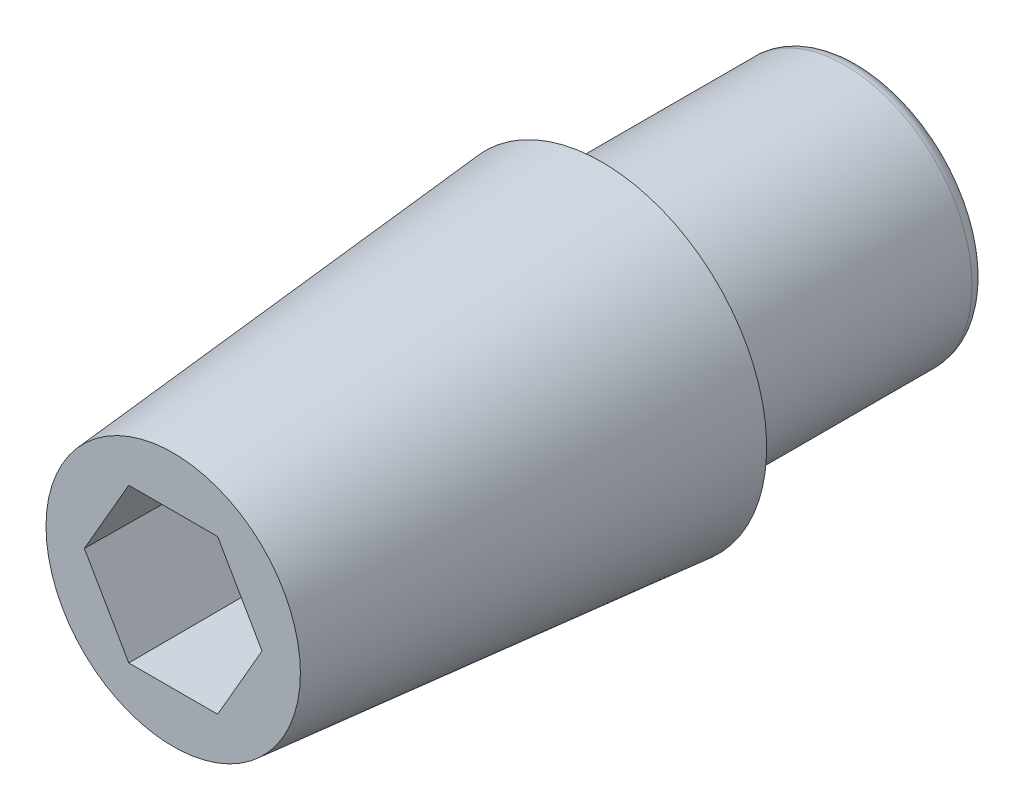
ISO-10303-21;
HEADER;
FILE_DESCRIPTION(('STEP AP214'),'2;1');
FILE_NAME('part.step','',(''),(''),'','','');
FILE_SCHEMA(('AUTOMOTIVE_DESIGN { 1 0 10303 214 1 1 1 1 }'));
ENDSEC;
DATA;
#1=APPLICATION_CONTEXT('core data for automotive mechanical design processes');
#2=APPLICATION_PROTOCOL_DEFINITION('international standard','automotive_design',2000,#1);
#3=PRODUCT_CONTEXT('',#1,'mechanical');
#4=PRODUCT('Part','Part','',(#3));
#5=PRODUCT_RELATED_PRODUCT_CATEGORY('part','',(#4));
#6=PRODUCT_DEFINITION_FORMATION('','',#4);
#7=PRODUCT_DEFINITION_CONTEXT('part definition',#1,'design');
#8=PRODUCT_DEFINITION('design','',#6,#7);
#9=PRODUCT_DEFINITION_SHAPE('','',#8);
#10=(LENGTH_UNIT() NAMED_UNIT(*) SI_UNIT(.MILLI.,.METRE.));
#11=(NAMED_UNIT(*) PLANE_ANGLE_UNIT() SI_UNIT($,.RADIAN.));
#12=(NAMED_UNIT(*) SI_UNIT($,.STERADIAN.) SOLID_ANGLE_UNIT());
#13=UNCERTAINTY_MEASURE_WITH_UNIT(LENGTH_MEASURE(1.E-05),#10,'distance_accuracy_value','');
#14=(GEOMETRIC_REPRESENTATION_CONTEXT(3) GLOBAL_UNCERTAINTY_ASSIGNED_CONTEXT((#13)) GLOBAL_UNIT_ASSIGNED_CONTEXT((#10,
#11,#12)) REPRESENTATION_CONTEXT('',''));
#15=CARTESIAN_POINT('',(0.,0.,0.));
#16=DIRECTION('',(0.,0.,1.));
#17=DIRECTION('',(1.,0.,0.));
#18=AXIS2_PLACEMENT_3D('',#15,#16,#17);
#19=CARTESIAN_POINT('',(-0.250000000000002,0.,-6.75));
#20=DIRECTION('',(0.,0.,1.));
#21=DIRECTION('',(1.,0.,0.));
#22=AXIS2_PLACEMENT_3D('',#19,#20,#21);
#23=PLANE('',#22);
#24=CARTESIAN_POINT('',(0.,0.,-6.75));
#25=DIRECTION('',(0.,0.,-1.));
#26=DIRECTION('',(0.,1.,0.));
#27=AXIS2_PLACEMENT_3D('',#24,#25,#26);
#28=CIRCLE('',#27,0.386494716716777);
#29=CARTESIAN_POINT('',(0.,0.386494716716777,-6.75));
#30=VERTEX_POINT('',#29);
#31=EDGE_CURVE('E20',#30,#30,#28,.T.);
#32=ORIENTED_EDGE('',*,*,#31,.F.);
#33=EDGE_LOOP('',(#32));
#34=FACE_BOUND('',#33,.T.);
#35=ADVANCED_FACE('F16',(#34),#23,.T.);
#36=CARTESIAN_POINT('',(0.,0.,-6.85));
#37=DIRECTION('',(0.,0.,-1.));
#38=DIRECTION('',(0.,1.,0.));
#39=AXIS2_PLACEMENT_3D('',#36,#37,#38);
#40=TOROIDAL_SURFACE('',#39,0.386494716716777,0.100000000000001);
#41=ORIENTED_EDGE('',*,*,#31,.T.);
#42=EDGE_LOOP('',(#41));
#43=FACE_BOUND('',#42,.T.);
#44=CARTESIAN_POINT('',(0.,0.,-6.84128442571819));
#45=DIRECTION('',(0.,0.,-1.));
#46=DIRECTION('',(-1.,0.,0.));
#47=AXIS2_PLACEMENT_3D('',#44,#45,#46);
#48=CIRCLE('',#47,0.486114186543316);
#49=CARTESIAN_POINT('',(-0.486114186543318,0.,-6.84128442571819));
#50=VERTEX_POINT('',#49);
#51=EDGE_CURVE('E106',#50,#50,#48,.T.);
#52=ORIENTED_EDGE('',*,*,#51,.F.);
#53=EDGE_LOOP('',(#52));
#54=FACE_BOUND('',#53,.T.);
#55=ADVANCED_FACE('F131',(#43,#54),#40,.T.);
#56=CARTESIAN_POINT('',(0.,0.,-6.90871557429773));
#57=DIRECTION('',(0.,0.,-1.));
#58=DIRECTION('',(0.,1.,0.));
#59=AXIS2_PLACEMENT_3D('',#56,#57,#58);
#60=CONICAL_SURFACE('',#59,0.492013647608756,0.087266462543748);
#61=ORIENTED_EDGE('',*,*,#51,.T.);
#62=EDGE_LOOP('',(#61));
#63=FACE_BOUND('',#62,.T.);
#64=CARTESIAN_POINT('',(0.,0.,-6.90871557427476));
#65=DIRECTION('',(0.,0.,1.));
#66=DIRECTION('',(1.,0.,0.));
#67=AXIS2_PLACEMENT_3D('',#64,#65,#66);
#68=CIRCLE('',#67,0.492013647592567);
#69=CARTESIAN_POINT('',(0.492013647592565,0.,-6.90871557427476));
#70=VERTEX_POINT('',#69);
#71=EDGE_CURVE('E102',#70,#70,#68,.T.);
#72=ORIENTED_EDGE('',*,*,#71,.T.);
#73=EDGE_LOOP('',(#72));
#74=FACE_BOUND('',#73,.T.);
#75=ADVANCED_FACE('F122',(#63,#74),#60,.T.);
#76=CARTESIAN_POINT('',(0.,0.,-6.9));
#77=DIRECTION('',(0.,0.,-1.));
#78=DIRECTION('',(-1.,0.,0.));
#79=AXIS2_PLACEMENT_3D('',#76,#77,#78);
#80=TOROIDAL_SURFACE('',#79,0.591633117401737,0.0999999999999965);
#81=ORIENTED_EDGE('',*,*,#71,.F.);
#82=EDGE_LOOP('',(#81));
#83=FACE_BOUND('',#82,.T.);
#84=CARTESIAN_POINT('',(0.,0.,-7.));
#85=DIRECTION('',(0.,0.,-1.));
#86=DIRECTION('',(-1.,0.,0.));
#87=AXIS2_PLACEMENT_3D('',#84,#85,#86);
#88=CIRCLE('',#87,0.591633117401743);
#89=CARTESIAN_POINT('',(-0.591633117401745,0.,-7.));
#90=VERTEX_POINT('',#89);
#91=EDGE_CURVE('E105',#90,#90,#88,.T.);
#92=ORIENTED_EDGE('',*,*,#91,.F.);
#93=EDGE_LOOP('',(#92));
#94=FACE_BOUND('',#93,.T.);
#95=ADVANCED_FACE('F119',(#83,#94),#80,.F.);
#96=CARTESIAN_POINT('',(2.225,0.,-9.));
#97=DIRECTION('',(0.,0.,-1.));
#98=DIRECTION('',(-1.,0.,0.));
#99=AXIS2_PLACEMENT_3D('',#96,#97,#98);
#100=PLANE('',#99);
#101=CARTESIAN_POINT('',(0.,0.,-9.));
#102=DIRECTION('',(0.,0.,1.));
#103=DIRECTION('',(0.,-1.,0.));
#104=AXIS2_PLACEMENT_3D('',#101,#102,#103);
#105=CIRCLE('',#104,3.95);
#106=CARTESIAN_POINT('',(0.,-3.95,-9.));
#107=VERTEX_POINT('',#106);
#108=EDGE_CURVE('E87',#107,#107,#105,.T.);
#109=ORIENTED_EDGE('',*,*,#108,.F.);
#110=EDGE_LOOP('',(#109));
#111=FACE_BOUND('',#110,.T.);
#112=ADVANCED_FACE('F121',(#111),#100,.T.);
#113=CARTESIAN_POINT('',(0.,0.,-7.));
#114=DIRECTION('',(0.,0.,1.));
#115=DIRECTION('',(1.,0.,0.));
#116=AXIS2_PLACEMENT_3D('',#113,#114,#115);
#117=PLANE('',#116);
#118=DIRECTION('',(-0.5,-0.866025403784439,0.));
#119=VECTOR('',#118,1.);
#120=CARTESIAN_POINT('',(-1.44337567297406,2.5,-7.));
#121=LINE('',#120,#119);
#122=CARTESIAN_POINT('',(-1.44337567297406,2.5,-7.));
#123=VERTEX_POINT('',#122);
#124=CARTESIAN_POINT('',(-2.88675134594813,0.,-7.));
#125=VERTEX_POINT('',#124);
#126=EDGE_CURVE('E328',#123,#125,#121,.T.);
#127=ORIENTED_EDGE('',*,*,#126,.T.);
#128=DIRECTION('',(0.499999999999999,-0.866025403784439,0.));
#129=VECTOR('',#128,1.);
#130=CARTESIAN_POINT('',(-2.88675134594813,0.,-7.));
#131=LINE('',#130,#129);
#132=CARTESIAN_POINT('',(-1.44337567297407,-2.5,-7.));
#133=VERTEX_POINT('',#132);
#134=EDGE_CURVE('E312',#125,#133,#131,.T.);
#135=ORIENTED_EDGE('',*,*,#134,.T.);
#136=DIRECTION('',(1.,0.,0.));
#137=VECTOR('',#136,1.);
#138=CARTESIAN_POINT('',(-1.44337567297407,-2.5,-7.));
#139=LINE('',#138,#137);
#140=CARTESIAN_POINT('',(1.44337567297406,-2.5,-7.));
#141=VERTEX_POINT('',#140);
#142=EDGE_CURVE('E307',#133,#141,#139,.T.);
#143=ORIENTED_EDGE('',*,*,#142,.T.);
#144=DIRECTION('',(0.5,0.866025403784439,0.));
#145=VECTOR('',#144,1.);
#146=CARTESIAN_POINT('',(1.44337567297406,-2.5,-7.));
#147=LINE('',#146,#145);
#148=CARTESIAN_POINT('',(2.88675134594813,0.,-7.));
#149=VERTEX_POINT('',#148);
#150=EDGE_CURVE('E68',#141,#149,#147,.T.);
#151=ORIENTED_EDGE('',*,*,#150,.T.);
#152=DIRECTION('',(-0.499999999999999,0.866025403784439,0.));
#153=VECTOR('',#152,1.);
#154=CARTESIAN_POINT('',(2.88675134594813,0.,-7.));
#155=LINE('',#154,#153);
#156=CARTESIAN_POINT('',(1.44337567297406,2.5,-7.));
#157=VERTEX_POINT('',#156);
#158=EDGE_CURVE('E70',#149,#157,#155,.T.);
#159=ORIENTED_EDGE('',*,*,#158,.T.);
#160=DIRECTION('',(1.,0.,0.));
#161=VECTOR('',#160,1.);
#162=CARTESIAN_POINT('',(1.44337567297406,2.5,-7.));
#163=LINE('',#162,#161);
#164=EDGE_CURVE('E74',#157,#123,#163,.F.);
#165=ORIENTED_EDGE('',*,*,#164,.T.);
#166=EDGE_LOOP('',(#127,#135,#143,#151,#159,#165));
#167=FACE_BOUND('',#166,.T.);
#168=ORIENTED_EDGE('',*,*,#91,.T.);
#169=EDGE_LOOP('',(#168));
#170=FACE_BOUND('',#169,.T.);
#171=ADVANCED_FACE('F72',(#167,#170),#117,.T.);
#172=CARTESIAN_POINT('',(0.,0.,-8.5));
#173=DIRECTION('',(0.,0.,1.));
#174=DIRECTION('',(0.,-1.,0.));
#175=AXIS2_PLACEMENT_3D('',#172,#173,#174);
#176=TOROIDAL_SURFACE('',#175,3.95,0.5);
#177=ORIENTED_EDGE('',*,*,#108,.T.);
#178=EDGE_LOOP('',(#177));
#179=FACE_BOUND('',#178,.T.);
#180=CARTESIAN_POINT('',(0.,0.,-8.5));
#181=DIRECTION('',(0.,0.,1.));
#182=DIRECTION('',(1.,0.,0.));
#183=AXIS2_PLACEMENT_3D('',#180,#181,#182);
#184=CIRCLE('',#183,4.45);
#185=CARTESIAN_POINT('',(4.45,0.,-8.5));
#186=VERTEX_POINT('',#185);
#187=EDGE_CURVE('E98',#186,#186,#184,.T.);
#188=ORIENTED_EDGE('',*,*,#187,.F.);
#189=EDGE_LOOP('',(#188));
#190=FACE_BOUND('',#189,.T.);
#191=ADVANCED_FACE('F18',(#179,#190),#176,.T.);
#192=CARTESIAN_POINT('',(1.44337567297406,2.5,-7.));
#193=DIRECTION('',(0.,0.999961923064171,-0.00872653549837401));
#194=DIRECTION('',(0.,0.00872653549837401,0.999961923064171));
#195=AXIS2_PLACEMENT_3D('',#192,#193,#194);
#196=PLANE('',#195);
#197=ORIENTED_EDGE('',*,*,#164,.F.);
#198=DIRECTION('',(0.00503820367424967,0.00872642474268049,0.999949231718764));
#199=VECTOR('',#198,1.);
#200=CARTESIAN_POINT('',(1.44337567297406,2.5,-7.));
#201=LINE('',#200,#199);
#202=CARTESIAN_POINT('',(1.55422178127396,2.69199109139669,15.));
#203=VERTEX_POINT('',#202);
#204=EDGE_CURVE('E79',#157,#203,#201,.T.);
#205=ORIENTED_EDGE('',*,*,#204,.T.);
#206=DIRECTION('',(1.,0.,0.));
#207=VECTOR('',#206,1.);
#208=CARTESIAN_POINT('',(2.225,2.6919910913967,15.));
#209=LINE('',#208,#207);
#210=CARTESIAN_POINT('',(-1.55422178127395,2.6919910913967,15.));
#211=VERTEX_POINT('',#210);
#212=EDGE_CURVE('E101',#211,#203,#209,.T.);
#213=ORIENTED_EDGE('',*,*,#212,.F.);
#214=DIRECTION('',(0.00503820367424958,-0.0087264247426806,-0.999949231718764));
#215=VECTOR('',#214,1.);
#216=CARTESIAN_POINT('',(-1.55422178127395,2.6919910913967,15.));
#217=LINE('',#216,#215);
#218=EDGE_CURVE('E85',#211,#123,#217,.T.);
#219=ORIENTED_EDGE('',*,*,#218,.T.);
#220=EDGE_LOOP('',(#197,#205,#213,#219));
#221=FACE_BOUND('',#220,.T.);
#222=ADVANCED_FACE('F82',(#221),#196,.F.);
#223=CARTESIAN_POINT('',(2.88675134594813,0.,-7.));
#224=DIRECTION('',(0.865992428190713,0.499980961532085,-0.008726535498374));
#225=DIRECTION('',(-0.499999999999999,0.866025403784439,0.));
#226=AXIS2_PLACEMENT_3D('',#223,#224,#225);
#227=PLANE('',#226);
#228=ORIENTED_EDGE('',*,*,#158,.F.);
#229=DIRECTION('',(0.0100764073484993,0.,0.999949231718764));
#230=VECTOR('',#229,1.);
#231=CARTESIAN_POINT('',(2.88675134594813,0.,-7.));
#232=LINE('',#231,#230);
#233=CARTESIAN_POINT('',(3.10844356254791,0.,15.));
#234=VERTEX_POINT('',#233);
#235=EDGE_CURVE('E94',#149,#234,#232,.T.);
#236=ORIENTED_EDGE('',*,*,#235,.T.);
#237=DIRECTION('',(0.499999999999999,-0.866025403784439,0.));
#238=VECTOR('',#237,1.);
#239=CARTESIAN_POINT('',(1.55422178127396,2.69199109139669,15.));
#240=LINE('',#239,#238);
#241=EDGE_CURVE('E91',#203,#234,#240,.T.);
#242=ORIENTED_EDGE('',*,*,#241,.F.);
#243=ORIENTED_EDGE('',*,*,#204,.F.);
#244=EDGE_LOOP('',(#228,#236,#242,#243));
#245=FACE_BOUND('',#244,.T.);
#246=ADVANCED_FACE('F89',(#245),#227,.F.);
#247=CARTESIAN_POINT('',(1.44337567297406,-2.5,-7.));
#248=DIRECTION('',(0.865992428190713,-0.499980961532086,-0.008726535498374));
#249=DIRECTION('',(0.5,0.866025403784439,0.));
#250=AXIS2_PLACEMENT_3D('',#247,#248,#249);
#251=PLANE('',#250);
#252=ORIENTED_EDGE('',*,*,#150,.F.);
#253=DIRECTION('',(0.00503820367424961,-0.00872642474268054,0.999949231718764));
#254=VECTOR('',#253,1.);
#255=CARTESIAN_POINT('',(1.44337567297406,-2.5,-7.));
#256=LINE('',#255,#254);
#257=CARTESIAN_POINT('',(1.55422178127395,-2.6919910913967,15.));
#258=VERTEX_POINT('',#257);
#259=EDGE_CURVE('E304',#141,#258,#256,.T.);
#260=ORIENTED_EDGE('',*,*,#259,.T.);
#261=DIRECTION('',(-0.5,-0.866025403784438,0.));
#262=VECTOR('',#261,1.);
#263=CARTESIAN_POINT('',(3.10844356254791,0.,15.));
#264=LINE('',#263,#262);
#265=EDGE_CURVE('E318',#234,#258,#264,.T.);
#266=ORIENTED_EDGE('',*,*,#265,.F.);
#267=ORIENTED_EDGE('',*,*,#235,.F.);
#268=EDGE_LOOP('',(#252,#260,#266,#267));
#269=FACE_BOUND('',#268,.T.);
#270=ADVANCED_FACE('F166',(#269),#251,.F.);
#271=CARTESIAN_POINT('',(-1.44337567297407,-2.5,-7.));
#272=DIRECTION('',(0.,-0.999961923064171,-0.00872653549837401));
#273=DIRECTION('',(0.,0.00872653549837401,-0.999961923064171));
#274=AXIS2_PLACEMENT_3D('',#271,#272,#273);
#275=PLANE('',#274);
#276=ORIENTED_EDGE('',*,*,#142,.F.);
#277=DIRECTION('',(-0.00503820367424962,-0.00872642474268057,0.999949231718764));
#278=VECTOR('',#277,1.);
#279=CARTESIAN_POINT('',(-1.44337567297407,-2.5,-7.));
#280=LINE('',#279,#278);
#281=CARTESIAN_POINT('',(-1.55422178127396,-2.69199109139669,15.));
#282=VERTEX_POINT('',#281);
#283=EDGE_CURVE('E314',#133,#282,#280,.T.);
#284=ORIENTED_EDGE('',*,*,#283,.T.);
#285=DIRECTION('',(1.,0.,0.));
#286=VECTOR('',#285,1.);
#287=CARTESIAN_POINT('',(2.225,-2.6919910913967,15.));
#288=LINE('',#287,#286);
#289=EDGE_CURVE('E310',#258,#282,#288,.F.);
#290=ORIENTED_EDGE('',*,*,#289,.F.);
#291=ORIENTED_EDGE('',*,*,#259,.F.);
#292=EDGE_LOOP('',(#276,#284,#290,#291));
#293=FACE_BOUND('',#292,.T.);
#294=ADVANCED_FACE('F163',(#293),#275,.F.);
#295=CARTESIAN_POINT('',(-2.88675134594813,0.,-7.));
#296=DIRECTION('',(-0.865992428190713,-0.499980961532085,-0.008726535498374));
#297=DIRECTION('',(0.499999999999999,-0.866025403784439,0.));
#298=AXIS2_PLACEMENT_3D('',#295,#296,#297);
#299=PLANE('',#298);
#300=ORIENTED_EDGE('',*,*,#134,.F.);
#301=DIRECTION('',(-0.0100764073484993,0.,0.999949231718764));
#302=VECTOR('',#301,1.);
#303=CARTESIAN_POINT('',(-2.88675134594813,0.,-7.));
#304=LINE('',#303,#302);
#305=CARTESIAN_POINT('',(-3.10844356254791,0.,15.));
#306=VERTEX_POINT('',#305);
#307=EDGE_CURVE('E35',#125,#306,#304,.T.);
#308=ORIENTED_EDGE('',*,*,#307,.T.);
#309=DIRECTION('',(-0.5,0.866025403784439,0.));
#310=VECTOR('',#309,1.);
#311=CARTESIAN_POINT('',(-1.55422178127396,-2.69199109139669,15.));
#312=LINE('',#311,#310);
#313=EDGE_CURVE('E330',#282,#306,#312,.T.);
#314=ORIENTED_EDGE('',*,*,#313,.F.);
#315=ORIENTED_EDGE('',*,*,#283,.F.);
#316=EDGE_LOOP('',(#300,#308,#314,#315));
#317=FACE_BOUND('',#316,.T.);
#318=ADVANCED_FACE('F159',(#317),#299,.F.);
#319=CARTESIAN_POINT('',(-1.44337567297406,2.5,-7.));
#320=DIRECTION('',(-0.865992428190713,0.499980961532086,-0.008726535498374));
#321=DIRECTION('',(-0.5,-0.866025403784439,0.));
#322=AXIS2_PLACEMENT_3D('',#319,#320,#321);
#323=PLANE('',#322);
#324=ORIENTED_EDGE('',*,*,#126,.F.);
#325=ORIENTED_EDGE('',*,*,#218,.F.);
#326=DIRECTION('',(0.5,0.866025403784438,0.));
#327=VECTOR('',#326,1.);
#328=CARTESIAN_POINT('',(-3.10844356254791,0.,15.));
#329=LINE('',#328,#327);
#330=EDGE_CURVE('E114',#306,#211,#329,.T.);
#331=ORIENTED_EDGE('',*,*,#330,.F.);
#332=ORIENTED_EDGE('',*,*,#307,.F.);
#333=EDGE_LOOP('',(#324,#325,#331,#332));
#334=FACE_BOUND('',#333,.T.);
#335=ADVANCED_FACE('F155',(#334),#323,.F.);
#336=CARTESIAN_POINT('',(0.,0.,3.));
#337=DIRECTION('',(0.,0.,1.));
#338=DIRECTION('',(1.,0.,0.));
#339=AXIS2_PLACEMENT_3D('',#336,#337,#338);
#340=CYLINDRICAL_SURFACE('',#339,4.45);
#341=ORIENTED_EDGE('',*,*,#187,.T.);
#342=EDGE_LOOP('',(#341));
#343=FACE_BOUND('',#342,.T.);
#344=CARTESIAN_POINT('',(0.,0.,0.));
#345=DIRECTION('',(0.,0.,1.));
#346=DIRECTION('',(1.,0.,0.));
#347=AXIS2_PLACEMENT_3D('',#344,#345,#346);
#348=CIRCLE('',#347,4.45);
#349=CARTESIAN_POINT('',(4.45,0.,0.));
#350=VERTEX_POINT('',#349);
#351=EDGE_CURVE('E111',#350,#350,#348,.T.);
#352=ORIENTED_EDGE('',*,*,#351,.F.);
#353=EDGE_LOOP('',(#352));
#354=FACE_BOUND('',#353,.T.);
#355=ADVANCED_FACE('F151',(#343,#354),#340,.T.);
#356=CARTESIAN_POINT('',(2.225,0.,15.));
#357=DIRECTION('',(0.,0.,1.));
#358=DIRECTION('',(1.,0.,0.));
#359=AXIS2_PLACEMENT_3D('',#356,#357,#358);
#360=PLANE('',#359);
#361=CARTESIAN_POINT('',(0.,0.,14.9999999999864));
#362=DIRECTION('',(0.,0.,-1.));
#363=DIRECTION('',(-1.,0.,0.));
#364=AXIS2_PLACEMENT_3D('',#361,#362,#363);
#365=CIRCLE('',#364,4.44999999999141);
#366=CARTESIAN_POINT('',(-4.44999999999141,0.,14.9999999999864));
#367=VERTEX_POINT('',#366);
#368=EDGE_CURVE('E26',#367,#367,#365,.T.);
#369=ORIENTED_EDGE('',*,*,#368,.F.);
#370=EDGE_LOOP('',(#369));
#371=FACE_BOUND('',#370,.T.);
#372=ORIENTED_EDGE('',*,*,#313,.T.);
#373=ORIENTED_EDGE('',*,*,#330,.T.);
#374=ORIENTED_EDGE('',*,*,#212,.T.);
#375=ORIENTED_EDGE('',*,*,#241,.T.);
#376=ORIENTED_EDGE('',*,*,#265,.T.);
#377=ORIENTED_EDGE('',*,*,#289,.T.);
#378=EDGE_LOOP('',(#372,#373,#374,#375,#376,#377));
#379=FACE_BOUND('',#378,.T.);
#380=ADVANCED_FACE('F144',(#371,#379),#360,.T.);
#381=CARTESIAN_POINT('',(4.45,0.,0.));
#382=DIRECTION('',(0.,0.,-1.));
#383=DIRECTION('',(-1.,0.,0.));
#384=AXIS2_PLACEMENT_3D('',#381,#382,#383);
#385=PLANE('',#384);
#386=CARTESIAN_POINT('',(0.,0.,-1.13686482306521E-10));
#387=DIRECTION('',(0.,0.,-1.));
#388=DIRECTION('',(-1.,0.,0.));
#389=AXIS2_PLACEMENT_3D('',#386,#387,#388);
#390=CIRCLE('',#389,5.76232995137573);
#391=CARTESIAN_POINT('',(-5.76232995137573,0.,-1.13686126891426E-10));
#392=VERTEX_POINT('',#391);
#393=EDGE_CURVE('E9',#392,#392,#390,.F.);
#394=ORIENTED_EDGE('',*,*,#393,.F.);
#395=EDGE_LOOP('',(#394));
#396=FACE_BOUND('',#395,.T.);
#397=ORIENTED_EDGE('',*,*,#351,.T.);
#398=EDGE_LOOP('',(#397));
#399=FACE_BOUND('',#398,.T.);
#400=ADVANCED_FACE('F138',(#396,#399),#385,.T.);
#401=CARTESIAN_POINT('',(0.,0.,-1.70530611997519E-10));
#402=DIRECTION('',(0.,0.,-1.));
#403=DIRECTION('',(-1.,0.,0.));
#404=AXIS2_PLACEMENT_3D('',#401,#402,#403);
#405=CONICAL_SURFACE('',#404,5.76232995138071,0.0872664624995971);
#406=ORIENTED_EDGE('',*,*,#393,.T.);
#407=EDGE_LOOP('',(#406));
#408=FACE_BOUND('',#407,.T.);
#409=ORIENTED_EDGE('',*,*,#368,.T.);
#410=EDGE_LOOP('',(#409));
#411=FACE_BOUND('',#410,.T.);
#412=ADVANCED_FACE('F136',(#408,#411),#405,.T.);
#413=CLOSED_SHELL('',(#35,#55,#75,#95,#112,#171,#191,#222,#246,#270,#294,#318,#335,#355,#380,
#400,#412));
#414=MANIFOLD_SOLID_BREP('B1',#413);
#415=ADVANCED_BREP_SHAPE_REPRESENTATION('',(#18,#414),#14);
#416=SHAPE_DEFINITION_REPRESENTATION(#9,#415);
ENDSEC;
END-ISO-10303-21;
